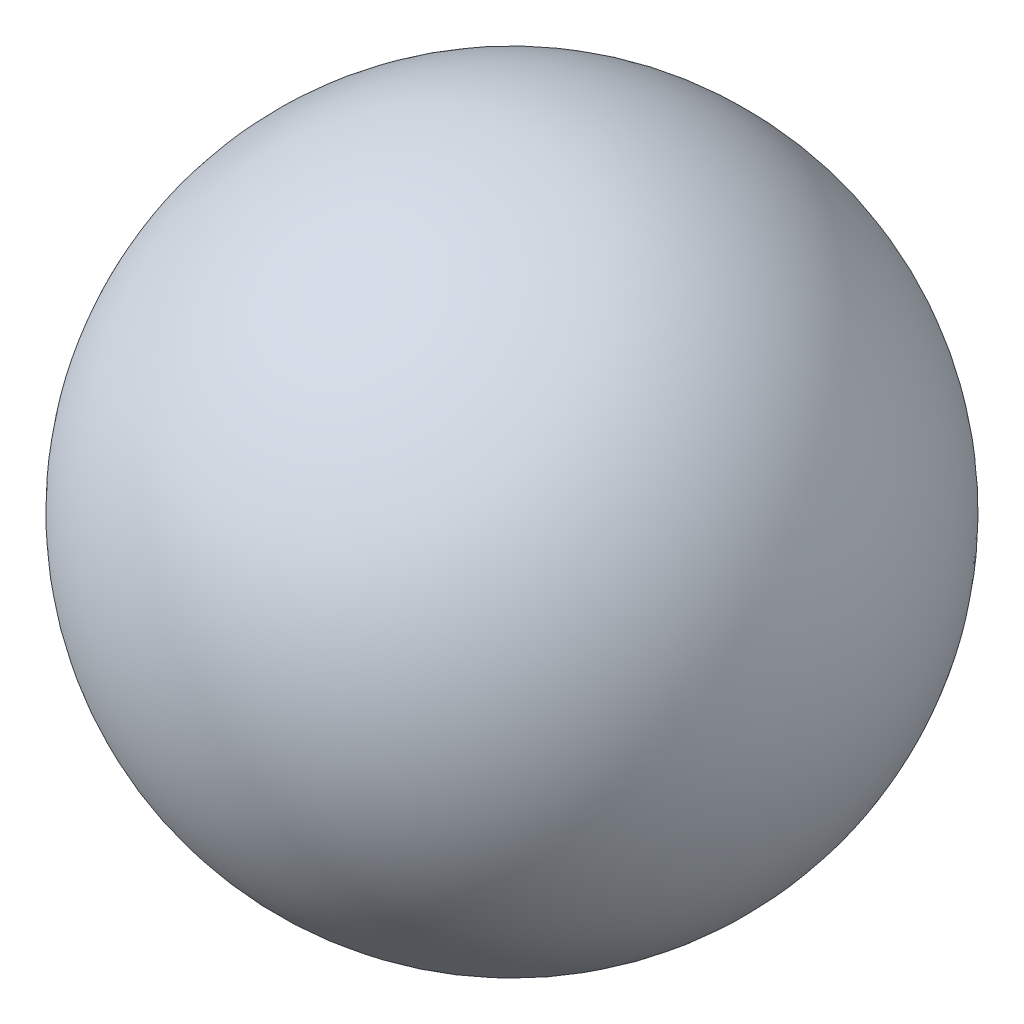
ISO-10303-21;
HEADER;
FILE_DESCRIPTION(('STEP AP214'),'2;1');
FILE_NAME('part.step','',(''),(''),'','','');
FILE_SCHEMA(('AUTOMOTIVE_DESIGN { 1 0 10303 214 1 1 1 1 }'));
ENDSEC;
DATA;
#1=APPLICATION_CONTEXT('core data for automotive mechanical design processes');
#2=APPLICATION_PROTOCOL_DEFINITION('international standard','automotive_design',2000,#1);
#3=PRODUCT_CONTEXT('',#1,'mechanical');
#4=PRODUCT('Part','Part','',(#3));
#5=PRODUCT_RELATED_PRODUCT_CATEGORY('part','',(#4));
#6=PRODUCT_DEFINITION_FORMATION('','',#4);
#7=PRODUCT_DEFINITION_CONTEXT('part definition',#1,'design');
#8=PRODUCT_DEFINITION('design','',#6,#7);
#9=PRODUCT_DEFINITION_SHAPE('','',#8);
#10=(LENGTH_UNIT() NAMED_UNIT(*) SI_UNIT(.MILLI.,.METRE.));
#11=(NAMED_UNIT(*) PLANE_ANGLE_UNIT() SI_UNIT($,.RADIAN.));
#12=(NAMED_UNIT(*) SI_UNIT($,.STERADIAN.) SOLID_ANGLE_UNIT());
#13=UNCERTAINTY_MEASURE_WITH_UNIT(LENGTH_MEASURE(1.E-05),#10,'distance_accuracy_value','');
#14=(GEOMETRIC_REPRESENTATION_CONTEXT(3) GLOBAL_UNCERTAINTY_ASSIGNED_CONTEXT((#13)) GLOBAL_UNIT_ASSIGNED_CONTEXT((#10,
#11,#12)) REPRESENTATION_CONTEXT('',''));
#15=CARTESIAN_POINT('',(0.,0.,0.));
#16=DIRECTION('',(0.,0.,1.));
#17=DIRECTION('',(1.,0.,0.));
#18=AXIS2_PLACEMENT_3D('',#15,#16,#17);
#19=CARTESIAN_POINT('',(0.,0.,0.));
#20=DIRECTION('',(0.,1.,0.));
#21=DIRECTION('',(0.,0.,1.));
#22=AXIS2_PLACEMENT_3D('',#19,#20,#21);
#23=PLANE('',#22);
#24=CARTESIAN_POINT('',(0.,0.,0.));
#25=DIRECTION('',(0.,1.,0.));
#26=DIRECTION('',(0.,0.,1.));
#27=AXIS2_PLACEMENT_3D('',#24,#25,#26);
#28=CIRCLE('',#27,4.);
#29=CARTESIAN_POINT('',(0.,0.,4.));
#30=VERTEX_POINT('',#29);
#31=EDGE_CURVE('E20',#30,#30,#28,.F.);
#32=ORIENTED_EDGE('',*,*,#31,.T.);
#33=EDGE_LOOP('',(#32));
#34=FACE_BOUND('',#33,.T.);
#35=ADVANCED_FACE('F17',(#34),#23,.F.);
#36=CARTESIAN_POINT('',(0.,0.,0.));
#37=DIRECTION('',(0.,1.,0.));
#38=DIRECTION('',(0.,0.,1.));
#39=AXIS2_PLACEMENT_3D('',#36,#37,#38);
#40=CYLINDRICAL_SURFACE('',#39,4.);
#41=ORIENTED_EDGE('',*,*,#31,.F.);
#42=EDGE_LOOP('',(#41));
#43=FACE_BOUND('',#42,.T.);
#44=CARTESIAN_POINT('',(0.,-14.4568322948,0.));
#45=DIRECTION('',(0.,1.,0.));
#46=DIRECTION('',(0.,0.,1.));
#47=AXIS2_PLACEMENT_3D('',#44,#45,#46);
#48=CIRCLE('',#47,4.);
#49=CARTESIAN_POINT('',(0.,-14.4568322948,4.));
#50=VERTEX_POINT('',#49);
#51=EDGE_CURVE('E11',#50,#50,#48,.T.);
#52=ORIENTED_EDGE('',*,*,#51,.F.);
#53=EDGE_LOOP('',(#52));
#54=FACE_BOUND('',#53,.T.);
#55=ADVANCED_FACE('F33',(#43,#54),#40,.F.);
#56=CARTESIAN_POINT('',(0.,0.,0.));
#57=DIRECTION('',(1.,0.,0.));
#58=DIRECTION('',(0.,0.,-1.));
#59=AXIS2_PLACEMENT_3D('',#56,#57,#58);
#60=SPHERICAL_SURFACE('',#59,15.);
#61=CARTESIAN_POINT('',(-15.,0.,0.));
#62=VERTEX_POINT('',#61);
#63=VERTEX_LOOP('',#62);
#64=FACE_BOUND('',#63,.T.);
#65=ORIENTED_EDGE('',*,*,#51,.T.);
#66=EDGE_LOOP('',(#65));
#67=FACE_BOUND('',#66,.T.);
#68=CARTESIAN_POINT('',(15.,0.,0.));
#69=VERTEX_POINT('',#68);
#70=VERTEX_LOOP('',#69);
#71=FACE_BOUND('',#70,.T.);
#72=ADVANCED_FACE('F30',(#64,#67,#71),#60,.T.);
#73=CLOSED_SHELL('',(#35,#55,#72));
#74=MANIFOLD_SOLID_BREP('B1',#73);
#75=ADVANCED_BREP_SHAPE_REPRESENTATION('',(#18,#74),#14);
#76=SHAPE_DEFINITION_REPRESENTATION(#9,#75);
ENDSEC;
END-ISO-10303-21;
